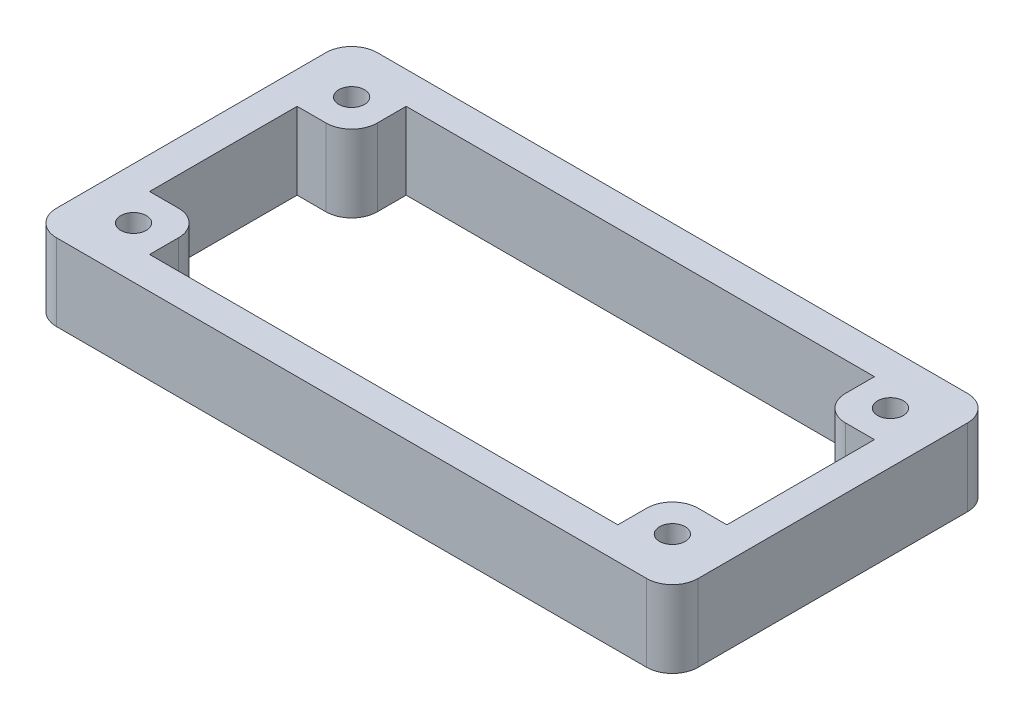
ISO-10303-21;
HEADER;
FILE_DESCRIPTION(('STEP AP214'),'2;1');
FILE_NAME('part.step','',(''),(''),'','','');
FILE_SCHEMA(('AUTOMOTIVE_DESIGN { 1 0 10303 214 1 1 1 1 }'));
ENDSEC;
DATA;
#1=APPLICATION_CONTEXT('core data for automotive mechanical design processes');
#2=APPLICATION_PROTOCOL_DEFINITION('international standard','automotive_design',2000,#1);
#3=PRODUCT_CONTEXT('',#1,'mechanical');
#4=PRODUCT('Part','Part','',(#3));
#5=PRODUCT_RELATED_PRODUCT_CATEGORY('part','',(#4));
#6=PRODUCT_DEFINITION_FORMATION('','',#4);
#7=PRODUCT_DEFINITION_CONTEXT('part definition',#1,'design');
#8=PRODUCT_DEFINITION('design','',#6,#7);
#9=PRODUCT_DEFINITION_SHAPE('','',#8);
#10=(LENGTH_UNIT() NAMED_UNIT(*) SI_UNIT(.MILLI.,.METRE.));
#11=(NAMED_UNIT(*) PLANE_ANGLE_UNIT() SI_UNIT($,.RADIAN.));
#12=(NAMED_UNIT(*) SI_UNIT($,.STERADIAN.) SOLID_ANGLE_UNIT());
#13=UNCERTAINTY_MEASURE_WITH_UNIT(LENGTH_MEASURE(1.E-05),#10,'distance_accuracy_value','');
#14=(GEOMETRIC_REPRESENTATION_CONTEXT(3) GLOBAL_UNCERTAINTY_ASSIGNED_CONTEXT((#13)) GLOBAL_UNIT_ASSIGNED_CONTEXT((#10,
#11,#12)) REPRESENTATION_CONTEXT('',''));
#15=CARTESIAN_POINT('',(0.,0.,0.));
#16=DIRECTION('',(0.,0.,1.));
#17=DIRECTION('',(1.,0.,0.));
#18=AXIS2_PLACEMENT_3D('',#15,#16,#17);
#19=CARTESIAN_POINT('',(0.,6.,0.));
#20=DIRECTION('',(0.,1.,0.));
#21=DIRECTION('',(0.,0.,1.));
#22=AXIS2_PLACEMENT_3D('',#19,#20,#21);
#23=PLANE('',#22);
#24=CARTESIAN_POINT('',(21.,6.,-8.5));
#25=DIRECTION('',(0.,1.,0.));
#26=DIRECTION('',(0.,0.,1.));
#27=AXIS2_PLACEMENT_3D('',#24,#25,#26);
#28=CIRCLE('',#27,0.999812184567984);
#29=CARTESIAN_POINT('',(21.,6.,-7.50018781543202));
#30=VERTEX_POINT('',#29);
#31=EDGE_CURVE('E343',#30,#30,#28,.T.);
#32=ORIENTED_EDGE('',*,*,#31,.F.);
#33=EDGE_LOOP('',(#32));
#34=FACE_BOUND('',#33,.T.);
#35=CARTESIAN_POINT('',(-21.,6.,8.5));
#36=DIRECTION('',(0.,1.,0.));
#37=DIRECTION('',(0.,0.,1.));
#38=AXIS2_PLACEMENT_3D('',#35,#36,#37);
#39=CIRCLE('',#38,1.);
#40=CARTESIAN_POINT('',(-21.,6.,9.5));
#41=VERTEX_POINT('',#40);
#42=EDGE_CURVE('E334',#41,#41,#39,.T.);
#43=ORIENTED_EDGE('',*,*,#42,.F.);
#44=EDGE_LOOP('',(#43));
#45=FACE_BOUND('',#44,.T.);
#46=CARTESIAN_POINT('',(21.,6.,8.5));
#47=DIRECTION('',(0.,1.,0.));
#48=DIRECTION('',(0.,0.,1.));
#49=AXIS2_PLACEMENT_3D('',#46,#47,#48);
#50=CIRCLE('',#49,1.);
#51=CARTESIAN_POINT('',(21.,6.,9.5));
#52=VERTEX_POINT('',#51);
#53=EDGE_CURVE('E225',#52,#52,#50,.T.);
#54=ORIENTED_EDGE('',*,*,#53,.F.);
#55=EDGE_LOOP('',(#54));
#56=FACE_BOUND('',#55,.T.);
#57=CARTESIAN_POINT('',(-21.,6.,-8.5));
#58=DIRECTION('',(0.,1.,0.));
#59=DIRECTION('',(0.,0.,1.));
#60=AXIS2_PLACEMENT_3D('',#57,#58,#59);
#61=CIRCLE('',#60,1.);
#62=CARTESIAN_POINT('',(-21.,6.,-7.5));
#63=VERTEX_POINT('',#62);
#64=EDGE_CURVE('E354',#63,#63,#61,.T.);
#65=ORIENTED_EDGE('',*,*,#64,.F.);
#66=EDGE_LOOP('',(#65));
#67=FACE_BOUND('',#66,.T.);
#68=DIRECTION('',(0.,0.,1.));
#69=VECTOR('',#68,1.);
#70=CARTESIAN_POINT('',(-25.,6.,-12.5));
#71=LINE('',#70,#69);
#72=CARTESIAN_POINT('',(-25.,6.,-10.5));
#73=VERTEX_POINT('',#72);
#74=CARTESIAN_POINT('',(-25.,6.,10.5));
#75=VERTEX_POINT('',#74);
#76=EDGE_CURVE('E371',#73,#75,#71,.T.);
#77=ORIENTED_EDGE('',*,*,#76,.T.);
#78=CARTESIAN_POINT('',(-23.,6.,10.5));
#79=DIRECTION('',(0.,1.,0.));
#80=DIRECTION('',(0.,0.,1.));
#81=AXIS2_PLACEMENT_3D('',#78,#79,#80);
#82=CIRCLE('',#81,2.);
#83=CARTESIAN_POINT('',(-23.,6.,12.5));
#84=VERTEX_POINT('',#83);
#85=EDGE_CURVE('E451',#75,#84,#82,.T.);
#86=ORIENTED_EDGE('',*,*,#85,.T.);
#87=DIRECTION('',(1.,0.,0.));
#88=VECTOR('',#87,1.);
#89=CARTESIAN_POINT('',(-25.,6.,12.5));
#90=LINE('',#89,#88);
#91=CARTESIAN_POINT('',(23.,6.,12.5));
#92=VERTEX_POINT('',#91);
#93=EDGE_CURVE('E375',#84,#92,#90,.T.);
#94=ORIENTED_EDGE('',*,*,#93,.T.);
#95=CARTESIAN_POINT('',(23.,6.,10.5));
#96=DIRECTION('',(0.,1.,0.));
#97=DIRECTION('',(0.,0.,1.));
#98=AXIS2_PLACEMENT_3D('',#95,#96,#97);
#99=CIRCLE('',#98,2.);
#100=CARTESIAN_POINT('',(25.,6.,10.5));
#101=VERTEX_POINT('',#100);
#102=EDGE_CURVE('E448',#92,#101,#99,.T.);
#103=ORIENTED_EDGE('',*,*,#102,.T.);
#104=DIRECTION('',(0.,0.,-1.));
#105=VECTOR('',#104,1.);
#106=CARTESIAN_POINT('',(25.,6.,-12.5));
#107=LINE('',#106,#105);
#108=CARTESIAN_POINT('',(25.,6.,-10.5));
#109=VERTEX_POINT('',#108);
#110=EDGE_CURVE('E362',#101,#109,#107,.T.);
#111=ORIENTED_EDGE('',*,*,#110,.T.);
#112=CARTESIAN_POINT('',(23.,6.,-10.5));
#113=DIRECTION('',(0.,1.,0.));
#114=DIRECTION('',(0.,0.,1.));
#115=AXIS2_PLACEMENT_3D('',#112,#113,#114);
#116=CIRCLE('',#115,2.);
#117=CARTESIAN_POINT('',(23.,6.,-12.5));
#118=VERTEX_POINT('',#117);
#119=EDGE_CURVE('E445',#109,#118,#116,.T.);
#120=ORIENTED_EDGE('',*,*,#119,.T.);
#121=DIRECTION('',(-1.,0.,0.));
#122=VECTOR('',#121,1.);
#123=CARTESIAN_POINT('',(-25.,6.,-12.5));
#124=LINE('',#123,#122);
#125=CARTESIAN_POINT('',(-23.,6.,-12.5));
#126=VERTEX_POINT('',#125);
#127=EDGE_CURVE('E366',#118,#126,#124,.T.);
#128=ORIENTED_EDGE('',*,*,#127,.T.);
#129=CARTESIAN_POINT('',(-23.,6.,-10.5));
#130=DIRECTION('',(0.,1.,0.));
#131=DIRECTION('',(0.,0.,1.));
#132=AXIS2_PLACEMENT_3D('',#129,#130,#131);
#133=CIRCLE('',#132,2.);
#134=EDGE_CURVE('E442',#126,#73,#133,.T.);
#135=ORIENTED_EDGE('',*,*,#134,.T.);
#136=EDGE_LOOP('',(#77,#86,#94,#103,#111,#120,#128,#135));
#137=FACE_BOUND('',#136,.T.);
#138=DIRECTION('',(1.,0.,0.));
#139=VECTOR('',#138,1.);
#140=CARTESIAN_POINT('',(18.25,6.,5.75));
#141=LINE('',#140,#139);
#142=CARTESIAN_POINT('',(20.25,6.,5.75));
#143=VERTEX_POINT('',#142);
#144=CARTESIAN_POINT('',(22.5,6.,5.75));
#145=VERTEX_POINT('',#144);
#146=EDGE_CURVE('E245',#143,#145,#141,.T.);
#147=ORIENTED_EDGE('',*,*,#146,.F.);
#148=CARTESIAN_POINT('',(20.25,6.,7.75));
#149=DIRECTION('',(0.,1.,0.));
#150=DIRECTION('',(0.,0.,1.));
#151=AXIS2_PLACEMENT_3D('',#148,#149,#150);
#152=CIRCLE('',#151,2.);
#153=CARTESIAN_POINT('',(18.25,6.,7.75));
#154=VERTEX_POINT('',#153);
#155=EDGE_CURVE('E439',#143,#154,#152,.T.);
#156=ORIENTED_EDGE('',*,*,#155,.T.);
#157=DIRECTION('',(0.,0.,-1.));
#158=VECTOR('',#157,1.);
#159=CARTESIAN_POINT('',(18.25,6.,10.));
#160=LINE('',#159,#158);
#161=CARTESIAN_POINT('',(18.25,6.,10.));
#162=VERTEX_POINT('',#161);
#163=EDGE_CURVE('E241',#162,#154,#160,.T.);
#164=ORIENTED_EDGE('',*,*,#163,.F.);
#165=DIRECTION('',(1.,0.,0.));
#166=VECTOR('',#165,1.);
#167=CARTESIAN_POINT('',(-18.25,6.,10.));
#168=LINE('',#167,#166);
#169=CARTESIAN_POINT('',(-18.25,6.,10.));
#170=VERTEX_POINT('',#169);
#171=EDGE_CURVE('E238',#170,#162,#168,.T.);
#172=ORIENTED_EDGE('',*,*,#171,.F.);
#173=DIRECTION('',(0.,0.,1.));
#174=VECTOR('',#173,1.);
#175=CARTESIAN_POINT('',(-18.25,6.,5.75));
#176=LINE('',#175,#174);
#177=CARTESIAN_POINT('',(-18.25,6.,7.75));
#178=VERTEX_POINT('',#177);
#179=EDGE_CURVE('E233',#178,#170,#176,.T.);
#180=ORIENTED_EDGE('',*,*,#179,.F.);
#181=CARTESIAN_POINT('',(-20.25,6.,7.75));
#182=DIRECTION('',(0.,1.,0.));
#183=DIRECTION('',(0.,0.,1.));
#184=AXIS2_PLACEMENT_3D('',#181,#182,#183);
#185=CIRCLE('',#184,2.);
#186=CARTESIAN_POINT('',(-20.25,6.,5.75));
#187=VERTEX_POINT('',#186);
#188=EDGE_CURVE('E59',#178,#187,#185,.T.);
#189=ORIENTED_EDGE('',*,*,#188,.T.);
#190=DIRECTION('',(1.,0.,0.));
#191=VECTOR('',#190,1.);
#192=CARTESIAN_POINT('',(-22.5,6.,5.75));
#193=LINE('',#192,#191);
#194=CARTESIAN_POINT('',(-22.5,6.,5.75));
#195=VERTEX_POINT('',#194);
#196=EDGE_CURVE('E229',#195,#187,#193,.T.);
#197=ORIENTED_EDGE('',*,*,#196,.F.);
#198=DIRECTION('',(0.,0.,1.));
#199=VECTOR('',#198,1.);
#200=CARTESIAN_POINT('',(-22.5,6.,-5.75));
#201=LINE('',#200,#199);
#202=CARTESIAN_POINT('',(-22.5,6.,-5.75));
#203=VERTEX_POINT('',#202);
#204=EDGE_CURVE('E215',#203,#195,#201,.T.);
#205=ORIENTED_EDGE('',*,*,#204,.F.);
#206=DIRECTION('',(-1.,0.,0.));
#207=VECTOR('',#206,1.);
#208=CARTESIAN_POINT('',(-22.5,6.,-5.75));
#209=LINE('',#208,#207);
#210=CARTESIAN_POINT('',(-20.25,6.,-5.75));
#211=VERTEX_POINT('',#210);
#212=EDGE_CURVE('E206',#211,#203,#209,.T.);
#213=ORIENTED_EDGE('',*,*,#212,.F.);
#214=CARTESIAN_POINT('',(-20.25,6.,-7.75));
#215=DIRECTION('',(0.,1.,0.));
#216=DIRECTION('',(0.,0.,1.));
#217=AXIS2_PLACEMENT_3D('',#214,#215,#216);
#218=CIRCLE('',#217,2.);
#219=CARTESIAN_POINT('',(-18.25,6.,-7.75));
#220=VERTEX_POINT('',#219);
#221=EDGE_CURVE('E431',#211,#220,#218,.T.);
#222=ORIENTED_EDGE('',*,*,#221,.T.);
#223=DIRECTION('',(0.,0.,1.));
#224=VECTOR('',#223,1.);
#225=CARTESIAN_POINT('',(-18.25,6.,-5.75));
#226=LINE('',#225,#224);
#227=CARTESIAN_POINT('',(-18.25,6.,-10.));
#228=VERTEX_POINT('',#227);
#229=EDGE_CURVE('E262',#228,#220,#226,.T.);
#230=ORIENTED_EDGE('',*,*,#229,.F.);
#231=DIRECTION('',(-1.,0.,0.));
#232=VECTOR('',#231,1.);
#233=CARTESIAN_POINT('',(18.25,6.,-10.));
#234=LINE('',#233,#232);
#235=CARTESIAN_POINT('',(18.25,6.,-10.));
#236=VERTEX_POINT('',#235);
#237=EDGE_CURVE('E258',#236,#228,#234,.T.);
#238=ORIENTED_EDGE('',*,*,#237,.F.);
#239=DIRECTION('',(0.,0.,-1.));
#240=VECTOR('',#239,1.);
#241=CARTESIAN_POINT('',(18.25,6.,-5.75));
#242=LINE('',#241,#240);
#243=CARTESIAN_POINT('',(18.25,6.,-7.75));
#244=VERTEX_POINT('',#243);
#245=EDGE_CURVE('E255',#244,#236,#242,.T.);
#246=ORIENTED_EDGE('',*,*,#245,.F.);
#247=CARTESIAN_POINT('',(20.25,6.,-7.75));
#248=DIRECTION('',(0.,1.,0.));
#249=DIRECTION('',(0.,0.,1.));
#250=AXIS2_PLACEMENT_3D('',#247,#248,#249);
#251=CIRCLE('',#250,2.);
#252=CARTESIAN_POINT('',(20.25,6.,-5.75));
#253=VERTEX_POINT('',#252);
#254=EDGE_CURVE('E436',#244,#253,#251,.T.);
#255=ORIENTED_EDGE('',*,*,#254,.T.);
#256=DIRECTION('',(-1.,0.,0.));
#257=VECTOR('',#256,1.);
#258=CARTESIAN_POINT('',(22.5,6.,-5.75));
#259=LINE('',#258,#257);
#260=CARTESIAN_POINT('',(22.5,6.,-5.75));
#261=VERTEX_POINT('',#260);
#262=EDGE_CURVE('E251',#261,#253,#259,.T.);
#263=ORIENTED_EDGE('',*,*,#262,.F.);
#264=DIRECTION('',(0.,0.,-1.));
#265=VECTOR('',#264,1.);
#266=CARTESIAN_POINT('',(22.5,6.,5.75));
#267=LINE('',#266,#265);
#268=EDGE_CURVE('E248',#145,#261,#267,.T.);
#269=ORIENTED_EDGE('',*,*,#268,.F.);
#270=EDGE_LOOP('',(#147,#156,#164,#172,#180,#189,#197,#205,#213,#222,#230,#238,#246,#255,#263,#269));
#271=FACE_BOUND('',#270,.T.);
#272=ADVANCED_FACE('F43',(#34,#45,#56,#67,#137,#271),#23,.T.);
#273=CARTESIAN_POINT('',(0.,0.,0.));
#274=DIRECTION('',(0.,1.,0.));
#275=DIRECTION('',(0.,0.,1.));
#276=AXIS2_PLACEMENT_3D('',#273,#274,#275);
#277=PLANE('',#276);
#278=DIRECTION('',(1.,0.,0.));
#279=VECTOR('',#278,1.);
#280=CARTESIAN_POINT('',(-25.,0.,12.5));
#281=LINE('',#280,#279);
#282=CARTESIAN_POINT('',(-23.,0.,12.5));
#283=VERTEX_POINT('',#282);
#284=CARTESIAN_POINT('',(23.,0.,12.5));
#285=VERTEX_POINT('',#284);
#286=EDGE_CURVE('E367',#283,#285,#281,.T.);
#287=ORIENTED_EDGE('',*,*,#286,.F.);
#288=CARTESIAN_POINT('',(-23.,0.,10.5));
#289=DIRECTION('',(0.,1.,0.));
#290=DIRECTION('',(0.,0.,1.));
#291=AXIS2_PLACEMENT_3D('',#288,#289,#290);
#292=CIRCLE('',#291,2.);
#293=CARTESIAN_POINT('',(-25.,0.,10.5));
#294=VERTEX_POINT('',#293);
#295=EDGE_CURVE('E421',#283,#294,#292,.F.);
#296=ORIENTED_EDGE('',*,*,#295,.T.);
#297=DIRECTION('',(0.,0.,1.));
#298=VECTOR('',#297,1.);
#299=CARTESIAN_POINT('',(-25.,0.,-12.5));
#300=LINE('',#299,#298);
#301=CARTESIAN_POINT('',(-25.,0.,-10.5));
#302=VERTEX_POINT('',#301);
#303=EDGE_CURVE('E387',#302,#294,#300,.T.);
#304=ORIENTED_EDGE('',*,*,#303,.F.);
#305=CARTESIAN_POINT('',(-23.,0.,-10.5));
#306=DIRECTION('',(0.,1.,0.));
#307=DIRECTION('',(0.,0.,1.));
#308=AXIS2_PLACEMENT_3D('',#305,#306,#307);
#309=CIRCLE('',#308,2.);
#310=CARTESIAN_POINT('',(-23.,0.,-12.5));
#311=VERTEX_POINT('',#310);
#312=EDGE_CURVE('E412',#302,#311,#309,.F.);
#313=ORIENTED_EDGE('',*,*,#312,.T.);
#314=DIRECTION('',(-1.,0.,0.));
#315=VECTOR('',#314,1.);
#316=CARTESIAN_POINT('',(-25.,0.,-12.5));
#317=LINE('',#316,#315);
#318=CARTESIAN_POINT('',(23.,0.,-12.5));
#319=VERTEX_POINT('',#318);
#320=EDGE_CURVE('E383',#319,#311,#317,.T.);
#321=ORIENTED_EDGE('',*,*,#320,.F.);
#322=CARTESIAN_POINT('',(23.,0.,-10.5));
#323=DIRECTION('',(0.,1.,0.));
#324=DIRECTION('',(0.,0.,1.));
#325=AXIS2_PLACEMENT_3D('',#322,#323,#324);
#326=CIRCLE('',#325,2.);
#327=CARTESIAN_POINT('',(25.,0.,-10.5));
#328=VERTEX_POINT('',#327);
#329=EDGE_CURVE('E415',#319,#328,#326,.F.);
#330=ORIENTED_EDGE('',*,*,#329,.T.);
#331=DIRECTION('',(0.,0.,-1.));
#332=VECTOR('',#331,1.);
#333=CARTESIAN_POINT('',(25.,0.,-12.5));
#334=LINE('',#333,#332);
#335=CARTESIAN_POINT('',(25.,0.,10.5));
#336=VERTEX_POINT('',#335);
#337=EDGE_CURVE('E358',#336,#328,#334,.T.);
#338=ORIENTED_EDGE('',*,*,#337,.F.);
#339=CARTESIAN_POINT('',(23.,0.,10.5));
#340=DIRECTION('',(0.,1.,0.));
#341=DIRECTION('',(0.,0.,1.));
#342=AXIS2_PLACEMENT_3D('',#339,#340,#341);
#343=CIRCLE('',#342,2.);
#344=EDGE_CURVE('E418',#336,#285,#343,.F.);
#345=ORIENTED_EDGE('',*,*,#344,.T.);
#346=EDGE_LOOP('',(#287,#296,#304,#313,#321,#330,#338,#345));
#347=FACE_BOUND('',#346,.T.);
#348=CARTESIAN_POINT('',(-21.,0.,-8.5));
#349=DIRECTION('',(0.,1.,0.));
#350=DIRECTION('',(0.,0.,1.));
#351=AXIS2_PLACEMENT_3D('',#348,#349,#350);
#352=CIRCLE('',#351,1.);
#353=CARTESIAN_POINT('',(-21.,0.,-7.5));
#354=VERTEX_POINT('',#353);
#355=EDGE_CURVE('E342',#354,#354,#352,.T.);
#356=ORIENTED_EDGE('',*,*,#355,.T.);
#357=EDGE_LOOP('',(#356));
#358=FACE_BOUND('',#357,.T.);
#359=CARTESIAN_POINT('',(21.,0.,8.5));
#360=DIRECTION('',(0.,1.,0.));
#361=DIRECTION('',(0.,0.,1.));
#362=AXIS2_PLACEMENT_3D('',#359,#360,#361);
#363=CIRCLE('',#362,1.);
#364=CARTESIAN_POINT('',(21.,0.,9.5));
#365=VERTEX_POINT('',#364);
#366=EDGE_CURVE('E330',#365,#365,#363,.T.);
#367=ORIENTED_EDGE('',*,*,#366,.T.);
#368=EDGE_LOOP('',(#367));
#369=FACE_BOUND('',#368,.T.);
#370=CARTESIAN_POINT('',(-21.,0.,8.5));
#371=DIRECTION('',(0.,1.,0.));
#372=DIRECTION('',(0.,0.,1.));
#373=AXIS2_PLACEMENT_3D('',#370,#371,#372);
#374=CIRCLE('',#373,1.);
#375=CARTESIAN_POINT('',(-21.,0.,9.5));
#376=VERTEX_POINT('',#375);
#377=EDGE_CURVE('E347',#376,#376,#374,.T.);
#378=ORIENTED_EDGE('',*,*,#377,.T.);
#379=EDGE_LOOP('',(#378));
#380=FACE_BOUND('',#379,.T.);
#381=CARTESIAN_POINT('',(21.,0.,-8.5));
#382=DIRECTION('',(0.,1.,0.));
#383=DIRECTION('',(0.,0.,1.));
#384=AXIS2_PLACEMENT_3D('',#381,#382,#383);
#385=CIRCLE('',#384,0.999812184567984);
#386=CARTESIAN_POINT('',(21.,0.,-7.50018781543202));
#387=VERTEX_POINT('',#386);
#388=EDGE_CURVE('E338',#387,#387,#385,.T.);
#389=ORIENTED_EDGE('',*,*,#388,.T.);
#390=EDGE_LOOP('',(#389));
#391=FACE_BOUND('',#390,.T.);
#392=DIRECTION('',(0.,0.,-1.));
#393=VECTOR('',#392,1.);
#394=CARTESIAN_POINT('',(18.25,0.,10.));
#395=LINE('',#394,#393);
#396=CARTESIAN_POINT('',(18.25,0.,10.));
#397=VERTEX_POINT('',#396);
#398=CARTESIAN_POINT('',(18.25,0.,7.75));
#399=VERTEX_POINT('',#398);
#400=EDGE_CURVE('E283',#397,#399,#395,.T.);
#401=ORIENTED_EDGE('',*,*,#400,.T.);
#402=CARTESIAN_POINT('',(20.25,0.,7.75));
#403=DIRECTION('',(0.,1.,0.));
#404=DIRECTION('',(0.,0.,1.));
#405=AXIS2_PLACEMENT_3D('',#402,#403,#404);
#406=CIRCLE('',#405,2.);
#407=CARTESIAN_POINT('',(20.25,0.,5.75));
#408=VERTEX_POINT('',#407);
#409=EDGE_CURVE('E409',#399,#408,#406,.F.);
#410=ORIENTED_EDGE('',*,*,#409,.T.);
#411=DIRECTION('',(1.,0.,0.));
#412=VECTOR('',#411,1.);
#413=CARTESIAN_POINT('',(18.25,0.,5.75));
#414=LINE('',#413,#412);
#415=CARTESIAN_POINT('',(22.5,0.,5.75));
#416=VERTEX_POINT('',#415);
#417=EDGE_CURVE('E287',#408,#416,#414,.T.);
#418=ORIENTED_EDGE('',*,*,#417,.T.);
#419=DIRECTION('',(0.,0.,-1.));
#420=VECTOR('',#419,1.);
#421=CARTESIAN_POINT('',(22.5,0.,5.75));
#422=LINE('',#421,#420);
#423=CARTESIAN_POINT('',(22.5,0.,-5.75));
#424=VERTEX_POINT('',#423);
#425=EDGE_CURVE('E290',#416,#424,#422,.T.);
#426=ORIENTED_EDGE('',*,*,#425,.T.);
#427=DIRECTION('',(-1.,0.,0.));
#428=VECTOR('',#427,1.);
#429=CARTESIAN_POINT('',(22.5,0.,-5.75));
#430=LINE('',#429,#428);
#431=CARTESIAN_POINT('',(20.25,0.,-5.75));
#432=VERTEX_POINT('',#431);
#433=EDGE_CURVE('E294',#424,#432,#430,.T.);
#434=ORIENTED_EDGE('',*,*,#433,.T.);
#435=CARTESIAN_POINT('',(20.25,0.,-7.75));
#436=DIRECTION('',(0.,1.,0.));
#437=DIRECTION('',(0.,0.,1.));
#438=AXIS2_PLACEMENT_3D('',#435,#436,#437);
#439=CIRCLE('',#438,2.);
#440=CARTESIAN_POINT('',(18.25,0.,-7.75));
#441=VERTEX_POINT('',#440);
#442=EDGE_CURVE('E406',#432,#441,#439,.F.);
#443=ORIENTED_EDGE('',*,*,#442,.T.);
#444=DIRECTION('',(0.,0.,-1.));
#445=VECTOR('',#444,1.);
#446=CARTESIAN_POINT('',(18.25,0.,-5.75));
#447=LINE('',#446,#445);
#448=CARTESIAN_POINT('',(18.25,0.,-10.));
#449=VERTEX_POINT('',#448);
#450=EDGE_CURVE('E298',#441,#449,#447,.T.);
#451=ORIENTED_EDGE('',*,*,#450,.T.);
#452=DIRECTION('',(-1.,0.,0.));
#453=VECTOR('',#452,1.);
#454=CARTESIAN_POINT('',(18.25,0.,-10.));
#455=LINE('',#454,#453);
#456=CARTESIAN_POINT('',(-18.25,0.,-10.));
#457=VERTEX_POINT('',#456);
#458=EDGE_CURVE('E301',#449,#457,#455,.T.);
#459=ORIENTED_EDGE('',*,*,#458,.T.);
#460=DIRECTION('',(0.,0.,1.));
#461=VECTOR('',#460,1.);
#462=CARTESIAN_POINT('',(-18.25,0.,-5.75));
#463=LINE('',#462,#461);
#464=CARTESIAN_POINT('',(-18.25,0.,-7.75));
#465=VERTEX_POINT('',#464);
#466=EDGE_CURVE('E216',#457,#465,#463,.T.);
#467=ORIENTED_EDGE('',*,*,#466,.T.);
#468=CARTESIAN_POINT('',(-20.25,0.,-7.75));
#469=DIRECTION('',(0.,1.,0.));
#470=DIRECTION('',(0.,0.,1.));
#471=AXIS2_PLACEMENT_3D('',#468,#469,#470);
#472=CIRCLE('',#471,2.);
#473=CARTESIAN_POINT('',(-20.25,0.,-5.75));
#474=VERTEX_POINT('',#473);
#475=EDGE_CURVE('E400',#465,#474,#472,.F.);
#476=ORIENTED_EDGE('',*,*,#475,.T.);
#477=DIRECTION('',(-1.,0.,0.));
#478=VECTOR('',#477,1.);
#479=CARTESIAN_POINT('',(-22.5,0.,-5.75));
#480=LINE('',#479,#478);
#481=CARTESIAN_POINT('',(-22.5,0.,-5.75));
#482=VERTEX_POINT('',#481);
#483=EDGE_CURVE('E267',#474,#482,#480,.T.);
#484=ORIENTED_EDGE('',*,*,#483,.T.);
#485=DIRECTION('',(0.,0.,1.));
#486=VECTOR('',#485,1.);
#487=CARTESIAN_POINT('',(-22.5,0.,-5.75));
#488=LINE('',#487,#486);
#489=CARTESIAN_POINT('',(-22.5,0.,5.75));
#490=VERTEX_POINT('',#489);
#491=EDGE_CURVE('E223',#482,#490,#488,.T.);
#492=ORIENTED_EDGE('',*,*,#491,.T.);
#493=DIRECTION('',(1.,0.,0.));
#494=VECTOR('',#493,1.);
#495=CARTESIAN_POINT('',(-22.5,0.,5.75));
#496=LINE('',#495,#494);
#497=CARTESIAN_POINT('',(-20.25,0.,5.75));
#498=VERTEX_POINT('',#497);
#499=EDGE_CURVE('E272',#490,#498,#496,.T.);
#500=ORIENTED_EDGE('',*,*,#499,.T.);
#501=CARTESIAN_POINT('',(-20.25,0.,7.75));
#502=DIRECTION('',(0.,1.,0.));
#503=DIRECTION('',(0.,0.,1.));
#504=AXIS2_PLACEMENT_3D('',#501,#502,#503);
#505=CIRCLE('',#504,2.);
#506=CARTESIAN_POINT('',(-18.25,0.,7.75));
#507=VERTEX_POINT('',#506);
#508=EDGE_CURVE('E403',#498,#507,#505,.F.);
#509=ORIENTED_EDGE('',*,*,#508,.T.);
#510=DIRECTION('',(0.,0.,1.));
#511=VECTOR('',#510,1.);
#512=CARTESIAN_POINT('',(-18.25,0.,5.75));
#513=LINE('',#512,#511);
#514=CARTESIAN_POINT('',(-18.25,0.,10.));
#515=VERTEX_POINT('',#514);
#516=EDGE_CURVE('E276',#507,#515,#513,.T.);
#517=ORIENTED_EDGE('',*,*,#516,.T.);
#518=DIRECTION('',(1.,0.,0.));
#519=VECTOR('',#518,1.);
#520=CARTESIAN_POINT('',(-18.25,0.,10.));
#521=LINE('',#520,#519);
#522=EDGE_CURVE('E279',#515,#397,#521,.T.);
#523=ORIENTED_EDGE('',*,*,#522,.T.);
#524=EDGE_LOOP('',(#401,#410,#418,#426,#434,#443,#451,#459,#467,#476,#484,#492,#500,#509,#517,#523));
#525=FACE_BOUND('',#524,.T.);
#526=ADVANCED_FACE('F496',(#347,#358,#369,#380,#391,#525),#277,.F.);
#527=CARTESIAN_POINT('',(25.,6.,-12.5));
#528=DIRECTION('',(-1.,0.,0.));
#529=DIRECTION('',(0.,0.,1.));
#530=AXIS2_PLACEMENT_3D('',#527,#528,#529);
#531=PLANE('',#530);
#532=ORIENTED_EDGE('',*,*,#110,.F.);
#533=DIRECTION('',(0.,-1.,0.));
#534=VECTOR('',#533,1.);
#535=CARTESIAN_POINT('',(25.,6.,10.5));
#536=LINE('',#535,#534);
#537=EDGE_CURVE('E457',#101,#336,#536,.T.);
#538=ORIENTED_EDGE('',*,*,#537,.T.);
#539=ORIENTED_EDGE('',*,*,#337,.T.);
#540=DIRECTION('',(0.,-1.,0.));
#541=VECTOR('',#540,1.);
#542=CARTESIAN_POINT('',(25.,6.,-10.5));
#543=LINE('',#542,#541);
#544=EDGE_CURVE('E454',#328,#109,#543,.F.);
#545=ORIENTED_EDGE('',*,*,#544,.T.);
#546=EDGE_LOOP('',(#532,#538,#539,#545));
#547=FACE_BOUND('',#546,.T.);
#548=ADVANCED_FACE('F517',(#547),#531,.F.);
#549=CARTESIAN_POINT('',(-25.,6.,-12.5));
#550=DIRECTION('',(0.,0.,1.));
#551=DIRECTION('',(1.,0.,0.));
#552=AXIS2_PLACEMENT_3D('',#549,#550,#551);
#553=PLANE('',#552);
#554=ORIENTED_EDGE('',*,*,#127,.F.);
#555=DIRECTION('',(0.,-1.,0.));
#556=VECTOR('',#555,1.);
#557=CARTESIAN_POINT('',(23.,6.,-12.5));
#558=LINE('',#557,#556);
#559=EDGE_CURVE('E464',#118,#319,#558,.T.);
#560=ORIENTED_EDGE('',*,*,#559,.T.);
#561=ORIENTED_EDGE('',*,*,#320,.T.);
#562=DIRECTION('',(0.,-1.,0.));
#563=VECTOR('',#562,1.);
#564=CARTESIAN_POINT('',(-23.,6.,-12.5));
#565=LINE('',#564,#563);
#566=EDGE_CURVE('E461',#311,#126,#565,.F.);
#567=ORIENTED_EDGE('',*,*,#566,.T.);
#568=EDGE_LOOP('',(#554,#560,#561,#567));
#569=FACE_BOUND('',#568,.T.);
#570=ADVANCED_FACE('F533',(#569),#553,.F.);
#571=CARTESIAN_POINT('',(-25.,6.,-12.5));
#572=DIRECTION('',(1.,0.,0.));
#573=DIRECTION('',(0.,0.,-1.));
#574=AXIS2_PLACEMENT_3D('',#571,#572,#573);
#575=PLANE('',#574);
#576=ORIENTED_EDGE('',*,*,#303,.T.);
#577=DIRECTION('',(0.,-1.,0.));
#578=VECTOR('',#577,1.);
#579=CARTESIAN_POINT('',(-25.,6.,10.5));
#580=LINE('',#579,#578);
#581=EDGE_CURVE('E428',#294,#75,#580,.F.);
#582=ORIENTED_EDGE('',*,*,#581,.T.);
#583=ORIENTED_EDGE('',*,*,#76,.F.);
#584=DIRECTION('',(0.,-1.,0.));
#585=VECTOR('',#584,1.);
#586=CARTESIAN_POINT('',(-25.,6.,-10.5));
#587=LINE('',#586,#585);
#588=EDGE_CURVE('E424',#73,#302,#587,.T.);
#589=ORIENTED_EDGE('',*,*,#588,.T.);
#590=EDGE_LOOP('',(#576,#582,#583,#589));
#591=FACE_BOUND('',#590,.T.);
#592=ADVANCED_FACE('F529',(#591),#575,.F.);
#593=CARTESIAN_POINT('',(-25.,6.,12.5));
#594=DIRECTION('',(0.,0.,-1.));
#595=DIRECTION('',(-1.,0.,0.));
#596=AXIS2_PLACEMENT_3D('',#593,#594,#595);
#597=PLANE('',#596);
#598=ORIENTED_EDGE('',*,*,#93,.F.);
#599=DIRECTION('',(0.,-1.,0.));
#600=VECTOR('',#599,1.);
#601=CARTESIAN_POINT('',(-23.,6.,12.5));
#602=LINE('',#601,#600);
#603=EDGE_CURVE('E396',#84,#283,#602,.T.);
#604=ORIENTED_EDGE('',*,*,#603,.T.);
#605=ORIENTED_EDGE('',*,*,#286,.T.);
#606=DIRECTION('',(0.,-1.,0.));
#607=VECTOR('',#606,1.);
#608=CARTESIAN_POINT('',(23.,6.,12.5));
#609=LINE('',#608,#607);
#610=EDGE_CURVE('E379',#285,#92,#609,.F.);
#611=ORIENTED_EDGE('',*,*,#610,.T.);
#612=EDGE_LOOP('',(#598,#604,#605,#611));
#613=FACE_BOUND('',#612,.T.);
#614=ADVANCED_FACE('F526',(#613),#597,.F.);
#615=CARTESIAN_POINT('',(-21.,6.,-8.5));
#616=DIRECTION('',(0.,-1.,0.));
#617=DIRECTION('',(0.,0.,-1.));
#618=AXIS2_PLACEMENT_3D('',#615,#616,#617);
#619=CYLINDRICAL_SURFACE('',#618,1.);
#620=ORIENTED_EDGE('',*,*,#64,.T.);
#621=EDGE_LOOP('',(#620));
#622=FACE_BOUND('',#621,.T.);
#623=ORIENTED_EDGE('',*,*,#355,.F.);
#624=EDGE_LOOP('',(#623));
#625=FACE_BOUND('',#624,.T.);
#626=ADVANCED_FACE('F523',(#622,#625),#619,.F.);
#627=CARTESIAN_POINT('',(21.,6.,8.5));
#628=DIRECTION('',(0.,-1.,0.));
#629=DIRECTION('',(0.,0.,-1.));
#630=AXIS2_PLACEMENT_3D('',#627,#628,#629);
#631=CYLINDRICAL_SURFACE('',#630,1.);
#632=ORIENTED_EDGE('',*,*,#53,.T.);
#633=EDGE_LOOP('',(#632));
#634=FACE_BOUND('',#633,.T.);
#635=ORIENTED_EDGE('',*,*,#366,.F.);
#636=EDGE_LOOP('',(#635));
#637=FACE_BOUND('',#636,.T.);
#638=ADVANCED_FACE('F613',(#634,#637),#631,.F.);
#639=CARTESIAN_POINT('',(-21.,6.,8.5));
#640=DIRECTION('',(0.,-1.,0.));
#641=DIRECTION('',(0.,0.,-1.));
#642=AXIS2_PLACEMENT_3D('',#639,#640,#641);
#643=CYLINDRICAL_SURFACE('',#642,1.);
#644=ORIENTED_EDGE('',*,*,#42,.T.);
#645=EDGE_LOOP('',(#644));
#646=FACE_BOUND('',#645,.T.);
#647=ORIENTED_EDGE('',*,*,#377,.F.);
#648=EDGE_LOOP('',(#647));
#649=FACE_BOUND('',#648,.T.);
#650=ADVANCED_FACE('F616',(#646,#649),#643,.F.);
#651=CARTESIAN_POINT('',(21.,6.,-8.5));
#652=DIRECTION('',(0.,-1.,0.));
#653=DIRECTION('',(0.,0.,-1.));
#654=AXIS2_PLACEMENT_3D('',#651,#652,#653);
#655=CYLINDRICAL_SURFACE('',#654,0.999812184567984);
#656=ORIENTED_EDGE('',*,*,#31,.T.);
#657=EDGE_LOOP('',(#656));
#658=FACE_BOUND('',#657,.T.);
#659=ORIENTED_EDGE('',*,*,#388,.F.);
#660=EDGE_LOOP('',(#659));
#661=FACE_BOUND('',#660,.T.);
#662=ADVANCED_FACE('F612',(#658,#661),#655,.F.);
#663=CARTESIAN_POINT('',(-22.5,6.,-5.75));
#664=DIRECTION('',(0.,0.,1.));
#665=DIRECTION('',(1.,0.,0.));
#666=AXIS2_PLACEMENT_3D('',#663,#664,#665);
#667=PLANE('',#666);
#668=ORIENTED_EDGE('',*,*,#483,.F.);
#669=DIRECTION('',(0.,-1.,0.));
#670=VECTOR('',#669,1.);
#671=CARTESIAN_POINT('',(-20.25,6.,-5.75));
#672=LINE('',#671,#670);
#673=EDGE_CURVE('E11',#474,#211,#672,.F.);
#674=ORIENTED_EDGE('',*,*,#673,.T.);
#675=ORIENTED_EDGE('',*,*,#212,.T.);
#676=DIRECTION('',(0.,-1.,0.));
#677=VECTOR('',#676,1.);
#678=CARTESIAN_POINT('',(-22.5,6.,-5.75));
#679=LINE('',#678,#677);
#680=EDGE_CURVE('E210',#203,#482,#679,.T.);
#681=ORIENTED_EDGE('',*,*,#680,.T.);
#682=EDGE_LOOP('',(#668,#674,#675,#681));
#683=FACE_BOUND('',#682,.T.);
#684=ADVANCED_FACE('F209',(#683),#667,.T.);
#685=CARTESIAN_POINT('',(-22.5,6.,-5.75));
#686=DIRECTION('',(1.,0.,0.));
#687=DIRECTION('',(0.,0.,-1.));
#688=AXIS2_PLACEMENT_3D('',#685,#686,#687);
#689=PLANE('',#688);
#690=ORIENTED_EDGE('',*,*,#491,.F.);
#691=ORIENTED_EDGE('',*,*,#680,.F.);
#692=ORIENTED_EDGE('',*,*,#204,.T.);
#693=DIRECTION('',(0.,-1.,0.));
#694=VECTOR('',#693,1.);
#695=CARTESIAN_POINT('',(-22.5,6.,5.75));
#696=LINE('',#695,#694);
#697=EDGE_CURVE('E226',#195,#490,#696,.T.);
#698=ORIENTED_EDGE('',*,*,#697,.T.);
#699=EDGE_LOOP('',(#690,#691,#692,#698));
#700=FACE_BOUND('',#699,.T.);
#701=ADVANCED_FACE('F220',(#700),#689,.T.);
#702=CARTESIAN_POINT('',(-22.5,6.,5.75));
#703=DIRECTION('',(0.,0.,-1.));
#704=DIRECTION('',(-1.,0.,0.));
#705=AXIS2_PLACEMENT_3D('',#702,#703,#704);
#706=PLANE('',#705);
#707=ORIENTED_EDGE('',*,*,#196,.T.);
#708=DIRECTION('',(0.,-1.,0.));
#709=VECTOR('',#708,1.);
#710=CARTESIAN_POINT('',(-20.25,6.,5.75));
#711=LINE('',#710,#709);
#712=EDGE_CURVE('E482',#187,#498,#711,.T.);
#713=ORIENTED_EDGE('',*,*,#712,.T.);
#714=ORIENTED_EDGE('',*,*,#499,.F.);
#715=ORIENTED_EDGE('',*,*,#697,.F.);
#716=EDGE_LOOP('',(#707,#713,#714,#715));
#717=FACE_BOUND('',#716,.T.);
#718=ADVANCED_FACE('F596',(#717),#706,.T.);
#719=CARTESIAN_POINT('',(-18.25,6.,5.75));
#720=DIRECTION('',(1.,0.,0.));
#721=DIRECTION('',(0.,0.,-1.));
#722=AXIS2_PLACEMENT_3D('',#719,#720,#721);
#723=PLANE('',#722);
#724=ORIENTED_EDGE('',*,*,#516,.F.);
#725=DIRECTION('',(0.,-1.,0.));
#726=VECTOR('',#725,1.);
#727=CARTESIAN_POINT('',(-18.25,6.,7.75));
#728=LINE('',#727,#726);
#729=EDGE_CURVE('E67',#507,#178,#728,.F.);
#730=ORIENTED_EDGE('',*,*,#729,.T.);
#731=ORIENTED_EDGE('',*,*,#179,.T.);
#732=DIRECTION('',(0.,-1.,0.));
#733=VECTOR('',#732,1.);
#734=CARTESIAN_POINT('',(-18.25,6.,10.));
#735=LINE('',#734,#733);
#736=EDGE_CURVE('E324',#170,#515,#735,.T.);
#737=ORIENTED_EDGE('',*,*,#736,.T.);
#738=EDGE_LOOP('',(#724,#730,#731,#737));
#739=FACE_BOUND('',#738,.T.);
#740=ADVANCED_FACE('F597',(#739),#723,.T.);
#741=CARTESIAN_POINT('',(-18.25,6.,10.));
#742=DIRECTION('',(0.,0.,-1.));
#743=DIRECTION('',(-1.,0.,0.));
#744=AXIS2_PLACEMENT_3D('',#741,#742,#743);
#745=PLANE('',#744);
#746=ORIENTED_EDGE('',*,*,#522,.F.);
#747=ORIENTED_EDGE('',*,*,#736,.F.);
#748=ORIENTED_EDGE('',*,*,#171,.T.);
#749=DIRECTION('',(0.,-1.,0.));
#750=VECTOR('',#749,1.);
#751=CARTESIAN_POINT('',(18.25,6.,10.));
#752=LINE('',#751,#750);
#753=EDGE_CURVE('E321',#162,#397,#752,.T.);
#754=ORIENTED_EDGE('',*,*,#753,.T.);
#755=EDGE_LOOP('',(#746,#747,#748,#754));
#756=FACE_BOUND('',#755,.T.);
#757=ADVANCED_FACE('F591',(#756),#745,.T.);
#758=CARTESIAN_POINT('',(18.25,6.,10.));
#759=DIRECTION('',(-1.,0.,0.));
#760=DIRECTION('',(0.,0.,1.));
#761=AXIS2_PLACEMENT_3D('',#758,#759,#760);
#762=PLANE('',#761);
#763=ORIENTED_EDGE('',*,*,#163,.T.);
#764=DIRECTION('',(0.,-1.,0.));
#765=VECTOR('',#764,1.);
#766=CARTESIAN_POINT('',(18.25,6.,7.75));
#767=LINE('',#766,#765);
#768=EDGE_CURVE('E468',#154,#399,#767,.T.);
#769=ORIENTED_EDGE('',*,*,#768,.T.);
#770=ORIENTED_EDGE('',*,*,#400,.F.);
#771=ORIENTED_EDGE('',*,*,#753,.F.);
#772=EDGE_LOOP('',(#763,#769,#770,#771));
#773=FACE_BOUND('',#772,.T.);
#774=ADVANCED_FACE('F585',(#773),#762,.T.);
#775=CARTESIAN_POINT('',(18.25,6.,5.75));
#776=DIRECTION('',(0.,0.,-1.));
#777=DIRECTION('',(-1.,0.,0.));
#778=AXIS2_PLACEMENT_3D('',#775,#776,#777);
#779=PLANE('',#778);
#780=ORIENTED_EDGE('',*,*,#417,.F.);
#781=DIRECTION('',(0.,-1.,0.));
#782=VECTOR('',#781,1.);
#783=CARTESIAN_POINT('',(20.25,6.,5.75));
#784=LINE('',#783,#782);
#785=EDGE_CURVE('E472',#408,#143,#784,.F.);
#786=ORIENTED_EDGE('',*,*,#785,.T.);
#787=ORIENTED_EDGE('',*,*,#146,.T.);
#788=DIRECTION('',(0.,-1.,0.));
#789=VECTOR('',#788,1.);
#790=CARTESIAN_POINT('',(22.5,6.,5.75));
#791=LINE('',#790,#789);
#792=EDGE_CURVE('E317',#145,#416,#791,.T.);
#793=ORIENTED_EDGE('',*,*,#792,.T.);
#794=EDGE_LOOP('',(#780,#786,#787,#793));
#795=FACE_BOUND('',#794,.T.);
#796=ADVANCED_FACE('F714',(#795),#779,.T.);
#797=CARTESIAN_POINT('',(22.5,6.,5.75));
#798=DIRECTION('',(-1.,0.,0.));
#799=DIRECTION('',(0.,0.,1.));
#800=AXIS2_PLACEMENT_3D('',#797,#798,#799);
#801=PLANE('',#800);
#802=ORIENTED_EDGE('',*,*,#425,.F.);
#803=ORIENTED_EDGE('',*,*,#792,.F.);
#804=ORIENTED_EDGE('',*,*,#268,.T.);
#805=DIRECTION('',(0.,-1.,0.));
#806=VECTOR('',#805,1.);
#807=CARTESIAN_POINT('',(22.5,6.,-5.75));
#808=LINE('',#807,#806);
#809=EDGE_CURVE('E314',#261,#424,#808,.T.);
#810=ORIENTED_EDGE('',*,*,#809,.T.);
#811=EDGE_LOOP('',(#802,#803,#804,#810));
#812=FACE_BOUND('',#811,.T.);
#813=ADVANCED_FACE('F576',(#812),#801,.T.);
#814=CARTESIAN_POINT('',(22.5,6.,-5.75));
#815=DIRECTION('',(0.,0.,1.));
#816=DIRECTION('',(1.,0.,0.));
#817=AXIS2_PLACEMENT_3D('',#814,#815,#816);
#818=PLANE('',#817);
#819=ORIENTED_EDGE('',*,*,#262,.T.);
#820=DIRECTION('',(0.,-1.,0.));
#821=VECTOR('',#820,1.);
#822=CARTESIAN_POINT('',(20.25,6.,-5.75));
#823=LINE('',#822,#821);
#824=EDGE_CURVE('E475',#253,#432,#823,.T.);
#825=ORIENTED_EDGE('',*,*,#824,.T.);
#826=ORIENTED_EDGE('',*,*,#433,.F.);
#827=ORIENTED_EDGE('',*,*,#809,.F.);
#828=EDGE_LOOP('',(#819,#825,#826,#827));
#829=FACE_BOUND('',#828,.T.);
#830=ADVANCED_FACE('F572',(#829),#818,.T.);
#831=CARTESIAN_POINT('',(18.25,6.,-5.75));
#832=DIRECTION('',(-1.,0.,0.));
#833=DIRECTION('',(0.,0.,1.));
#834=AXIS2_PLACEMENT_3D('',#831,#832,#833);
#835=PLANE('',#834);
#836=ORIENTED_EDGE('',*,*,#450,.F.);
#837=DIRECTION('',(0.,-1.,0.));
#838=VECTOR('',#837,1.);
#839=CARTESIAN_POINT('',(18.25,6.,-7.75));
#840=LINE('',#839,#838);
#841=EDGE_CURVE('E479',#441,#244,#840,.F.);
#842=ORIENTED_EDGE('',*,*,#841,.T.);
#843=ORIENTED_EDGE('',*,*,#245,.T.);
#844=DIRECTION('',(0.,-1.,0.));
#845=VECTOR('',#844,1.);
#846=CARTESIAN_POINT('',(18.25,6.,-10.));
#847=LINE('',#846,#845);
#848=EDGE_CURVE('E310',#236,#449,#847,.T.);
#849=ORIENTED_EDGE('',*,*,#848,.T.);
#850=EDGE_LOOP('',(#836,#842,#843,#849));
#851=FACE_BOUND('',#850,.T.);
#852=ADVANCED_FACE('F727',(#851),#835,.T.);
#853=CARTESIAN_POINT('',(18.25,6.,-10.));
#854=DIRECTION('',(0.,0.,1.));
#855=DIRECTION('',(1.,0.,0.));
#856=AXIS2_PLACEMENT_3D('',#853,#854,#855);
#857=PLANE('',#856);
#858=ORIENTED_EDGE('',*,*,#458,.F.);
#859=ORIENTED_EDGE('',*,*,#848,.F.);
#860=ORIENTED_EDGE('',*,*,#237,.T.);
#861=DIRECTION('',(0.,-1.,0.));
#862=VECTOR('',#861,1.);
#863=CARTESIAN_POINT('',(-18.25,6.,-10.));
#864=LINE('',#863,#862);
#865=EDGE_CURVE('E266',#228,#457,#864,.T.);
#866=ORIENTED_EDGE('',*,*,#865,.T.);
#867=EDGE_LOOP('',(#858,#859,#860,#866));
#868=FACE_BOUND('',#867,.T.);
#869=ADVANCED_FACE('F501',(#868),#857,.T.);
#870=CARTESIAN_POINT('',(-18.25,6.,-5.75));
#871=DIRECTION('',(1.,0.,0.));
#872=DIRECTION('',(0.,0.,-1.));
#873=AXIS2_PLACEMENT_3D('',#870,#871,#872);
#874=PLANE('',#873);
#875=ORIENTED_EDGE('',*,*,#229,.T.);
#876=DIRECTION('',(0.,-1.,0.));
#877=VECTOR('',#876,1.);
#878=CARTESIAN_POINT('',(-18.25,6.,-7.75));
#879=LINE('',#878,#877);
#880=EDGE_CURVE('E52',#220,#465,#879,.T.);
#881=ORIENTED_EDGE('',*,*,#880,.T.);
#882=ORIENTED_EDGE('',*,*,#466,.F.);
#883=ORIENTED_EDGE('',*,*,#865,.F.);
#884=EDGE_LOOP('',(#875,#881,#882,#883));
#885=FACE_BOUND('',#884,.T.);
#886=ADVANCED_FACE('F492',(#885),#874,.T.);
#887=CARTESIAN_POINT('',(-23.,6.,10.5));
#888=DIRECTION('',(0.,-1.,0.));
#889=DIRECTION('',(0.,0.,-1.));
#890=AXIS2_PLACEMENT_3D('',#887,#888,#889);
#891=CYLINDRICAL_SURFACE('',#890,2.);
#892=ORIENTED_EDGE('',*,*,#85,.F.);
#893=ORIENTED_EDGE('',*,*,#581,.F.);
#894=ORIENTED_EDGE('',*,*,#295,.F.);
#895=ORIENTED_EDGE('',*,*,#603,.F.);
#896=EDGE_LOOP('',(#892,#893,#894,#895));
#897=FACE_BOUND('',#896,.T.);
#898=ADVANCED_FACE('F541',(#897),#891,.T.);
#899=CARTESIAN_POINT('',(23.,6.,10.5));
#900=DIRECTION('',(0.,-1.,0.));
#901=DIRECTION('',(0.,0.,-1.));
#902=AXIS2_PLACEMENT_3D('',#899,#900,#901);
#903=CYLINDRICAL_SURFACE('',#902,2.);
#904=ORIENTED_EDGE('',*,*,#102,.F.);
#905=ORIENTED_EDGE('',*,*,#610,.F.);
#906=ORIENTED_EDGE('',*,*,#344,.F.);
#907=ORIENTED_EDGE('',*,*,#537,.F.);
#908=EDGE_LOOP('',(#904,#905,#906,#907));
#909=FACE_BOUND('',#908,.T.);
#910=ADVANCED_FACE('F544',(#909),#903,.T.);
#911=CARTESIAN_POINT('',(23.,6.,-10.5));
#912=DIRECTION('',(0.,-1.,0.));
#913=DIRECTION('',(0.,0.,-1.));
#914=AXIS2_PLACEMENT_3D('',#911,#912,#913);
#915=CYLINDRICAL_SURFACE('',#914,2.);
#916=ORIENTED_EDGE('',*,*,#119,.F.);
#917=ORIENTED_EDGE('',*,*,#544,.F.);
#918=ORIENTED_EDGE('',*,*,#329,.F.);
#919=ORIENTED_EDGE('',*,*,#559,.F.);
#920=EDGE_LOOP('',(#916,#917,#918,#919));
#921=FACE_BOUND('',#920,.T.);
#922=ADVANCED_FACE('F548',(#921),#915,.T.);
#923=CARTESIAN_POINT('',(-23.,6.,-10.5));
#924=DIRECTION('',(0.,-1.,0.));
#925=DIRECTION('',(0.,0.,-1.));
#926=AXIS2_PLACEMENT_3D('',#923,#924,#925);
#927=CYLINDRICAL_SURFACE('',#926,2.);
#928=ORIENTED_EDGE('',*,*,#134,.F.);
#929=ORIENTED_EDGE('',*,*,#566,.F.);
#930=ORIENTED_EDGE('',*,*,#312,.F.);
#931=ORIENTED_EDGE('',*,*,#588,.F.);
#932=EDGE_LOOP('',(#928,#929,#930,#931));
#933=FACE_BOUND('',#932,.T.);
#934=ADVANCED_FACE('F552',(#933),#927,.T.);
#935=CARTESIAN_POINT('',(20.25,6.,7.75));
#936=DIRECTION('',(0.,-1.,0.));
#937=DIRECTION('',(0.,0.,-1.));
#938=AXIS2_PLACEMENT_3D('',#935,#936,#937);
#939=CYLINDRICAL_SURFACE('',#938,2.);
#940=ORIENTED_EDGE('',*,*,#155,.F.);
#941=ORIENTED_EDGE('',*,*,#785,.F.);
#942=ORIENTED_EDGE('',*,*,#409,.F.);
#943=ORIENTED_EDGE('',*,*,#768,.F.);
#944=EDGE_LOOP('',(#940,#941,#942,#943));
#945=FACE_BOUND('',#944,.T.);
#946=ADVANCED_FACE('F556',(#945),#939,.T.);
#947=CARTESIAN_POINT('',(20.25,6.,-7.75));
#948=DIRECTION('',(0.,-1.,0.));
#949=DIRECTION('',(0.,0.,-1.));
#950=AXIS2_PLACEMENT_3D('',#947,#948,#949);
#951=CYLINDRICAL_SURFACE('',#950,2.);
#952=ORIENTED_EDGE('',*,*,#254,.F.);
#953=ORIENTED_EDGE('',*,*,#841,.F.);
#954=ORIENTED_EDGE('',*,*,#442,.F.);
#955=ORIENTED_EDGE('',*,*,#824,.F.);
#956=EDGE_LOOP('',(#952,#953,#954,#955));
#957=FACE_BOUND('',#956,.T.);
#958=ADVANCED_FACE('F509',(#957),#951,.T.);
#959=CARTESIAN_POINT('',(-20.25,6.,7.75));
#960=DIRECTION('',(0.,-1.,0.));
#961=DIRECTION('',(0.,0.,-1.));
#962=AXIS2_PLACEMENT_3D('',#959,#960,#961);
#963=CYLINDRICAL_SURFACE('',#962,2.);
#964=ORIENTED_EDGE('',*,*,#188,.F.);
#965=ORIENTED_EDGE('',*,*,#729,.F.);
#966=ORIENTED_EDGE('',*,*,#508,.F.);
#967=ORIENTED_EDGE('',*,*,#712,.F.);
#968=EDGE_LOOP('',(#964,#965,#966,#967));
#969=FACE_BOUND('',#968,.T.);
#970=ADVANCED_FACE('F505',(#969),#963,.T.);
#971=CARTESIAN_POINT('',(-20.25,6.,-7.75));
#972=DIRECTION('',(0.,-1.,0.));
#973=DIRECTION('',(0.,0.,-1.));
#974=AXIS2_PLACEMENT_3D('',#971,#972,#973);
#975=CYLINDRICAL_SURFACE('',#974,2.);
#976=ORIENTED_EDGE('',*,*,#221,.F.);
#977=ORIENTED_EDGE('',*,*,#673,.F.);
#978=ORIENTED_EDGE('',*,*,#475,.F.);
#979=ORIENTED_EDGE('',*,*,#880,.F.);
#980=EDGE_LOOP('',(#976,#977,#978,#979));
#981=FACE_BOUND('',#980,.T.);
#982=ADVANCED_FACE('F45',(#981),#975,.T.);
#983=CLOSED_SHELL('',(#272,#526,#548,#570,#592,#614,#626,#638,#650,#662,#684,#701,#718,#740,
#757,#774,#796,#813,#830,#852,#869,#886,#898,#910,#922,#934,#946,#958,#970,#982));
#984=MANIFOLD_SOLID_BREP('B2',#983);
#985=ADVANCED_BREP_SHAPE_REPRESENTATION('',(#18,#984),#14);
#986=SHAPE_DEFINITION_REPRESENTATION(#9,#985);
ENDSEC;
END-ISO-10303-21;
